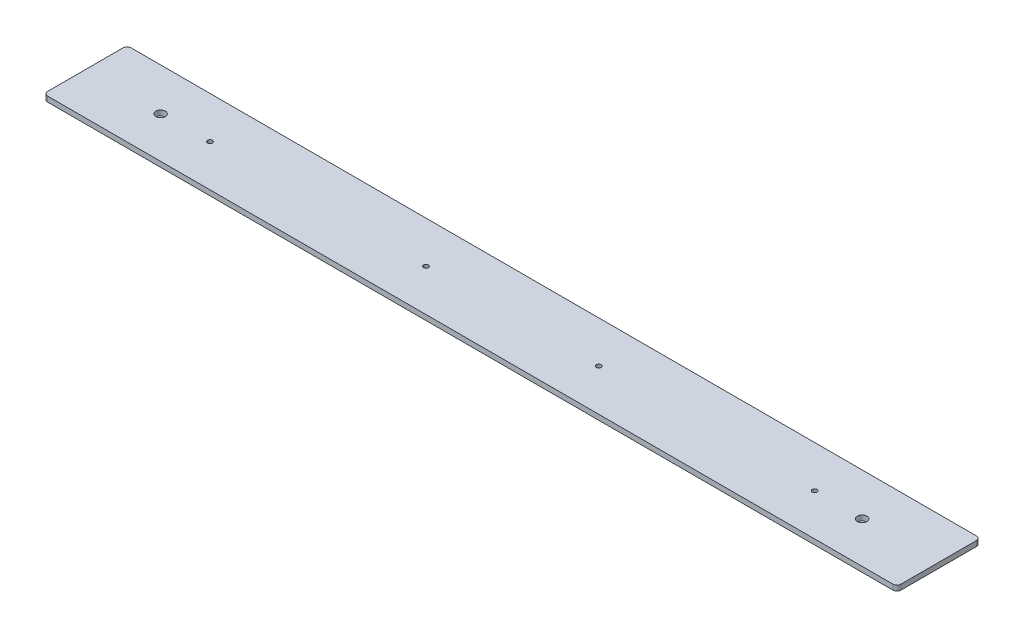
ISO-10303-21;
HEADER;
FILE_DESCRIPTION(('STEP AP214'),'2;1');
FILE_NAME('part.step','',(''),(''),'','','');
FILE_SCHEMA(('AUTOMOTIVE_DESIGN { 1 0 10303 214 1 1 1 1 }'));
ENDSEC;
DATA;
#1=APPLICATION_CONTEXT('core data for automotive mechanical design processes');
#2=APPLICATION_PROTOCOL_DEFINITION('international standard','automotive_design',2000,#1);
#3=PRODUCT_CONTEXT('',#1,'mechanical');
#4=PRODUCT('Part','Part','',(#3));
#5=PRODUCT_RELATED_PRODUCT_CATEGORY('part','',(#4));
#6=PRODUCT_DEFINITION_FORMATION('','',#4);
#7=PRODUCT_DEFINITION_CONTEXT('part definition',#1,'design');
#8=PRODUCT_DEFINITION('design','',#6,#7);
#9=PRODUCT_DEFINITION_SHAPE('','',#8);
#10=(LENGTH_UNIT() NAMED_UNIT(*) SI_UNIT(.MILLI.,.METRE.));
#11=(NAMED_UNIT(*) PLANE_ANGLE_UNIT() SI_UNIT($,.RADIAN.));
#12=(NAMED_UNIT(*) SI_UNIT($,.STERADIAN.) SOLID_ANGLE_UNIT());
#13=UNCERTAINTY_MEASURE_WITH_UNIT(LENGTH_MEASURE(1.E-05),#10,'distance_accuracy_value','');
#14=(GEOMETRIC_REPRESENTATION_CONTEXT(3) GLOBAL_UNCERTAINTY_ASSIGNED_CONTEXT((#13)) GLOBAL_UNIT_ASSIGNED_CONTEXT((#10,
#11,#12)) REPRESENTATION_CONTEXT('',''));
#15=CARTESIAN_POINT('',(0.,0.,0.));
#16=DIRECTION('',(0.,0.,1.));
#17=DIRECTION('',(1.,0.,0.));
#18=AXIS2_PLACEMENT_3D('',#15,#16,#17);
#19=CARTESIAN_POINT('',(259.55625,3.175,25.4));
#20=DIRECTION('',(-1.,0.,0.));
#21=DIRECTION('',(0.,0.,1.));
#22=AXIS2_PLACEMENT_3D('',#19,#20,#21);
#23=PLANE('',#22);
#24=DIRECTION('',(0.,0.,-1.));
#25=VECTOR('',#24,1.);
#26=CARTESIAN_POINT('',(259.55625,0.,25.4));
#27=LINE('',#26,#25);
#28=CARTESIAN_POINT('',(259.55625,0.,22.86));
#29=VERTEX_POINT('',#28);
#30=CARTESIAN_POINT('',(259.55625,0.,-22.86));
#31=VERTEX_POINT('',#30);
#32=EDGE_CURVE('E129',#29,#31,#27,.T.);
#33=ORIENTED_EDGE('',*,*,#32,.T.);
#34=DIRECTION('',(0.,-1.,0.));
#35=VECTOR('',#34,1.);
#36=CARTESIAN_POINT('',(259.55625,3.175,-22.86));
#37=LINE('',#36,#35);
#38=CARTESIAN_POINT('',(259.55625,3.175,-22.86));
#39=VERTEX_POINT('',#38);
#40=EDGE_CURVE('E11',#31,#39,#37,.F.);
#41=ORIENTED_EDGE('',*,*,#40,.T.);
#42=DIRECTION('',(0.,0.,-1.));
#43=VECTOR('',#42,1.);
#44=CARTESIAN_POINT('',(259.55625,3.175,25.4));
#45=LINE('',#44,#43);
#46=CARTESIAN_POINT('',(259.55625,3.175,22.86));
#47=VERTEX_POINT('',#46);
#48=EDGE_CURVE('E127',#47,#39,#45,.T.);
#49=ORIENTED_EDGE('',*,*,#48,.F.);
#50=DIRECTION('',(0.,-1.,0.));
#51=VECTOR('',#50,1.);
#52=CARTESIAN_POINT('',(259.55625,3.175,22.86));
#53=LINE('',#52,#51);
#54=EDGE_CURVE('E41',#47,#29,#53,.T.);
#55=ORIENTED_EDGE('',*,*,#54,.T.);
#56=EDGE_LOOP('',(#33,#41,#49,#55));
#57=FACE_BOUND('',#56,.T.);
#58=ADVANCED_FACE('F33',(#57),#23,.F.);
#59=CARTESIAN_POINT('',(-259.55625,3.175,-25.4));
#60=DIRECTION('',(0.,0.,1.));
#61=DIRECTION('',(1.,0.,0.));
#62=AXIS2_PLACEMENT_3D('',#59,#60,#61);
#63=PLANE('',#62);
#64=DIRECTION('',(-1.,0.,0.));
#65=VECTOR('',#64,1.);
#66=CARTESIAN_POINT('',(-259.55625,0.,-25.4));
#67=LINE('',#66,#65);
#68=CARTESIAN_POINT('',(257.01625,0.,-25.4));
#69=VERTEX_POINT('',#68);
#70=CARTESIAN_POINT('',(-257.01625,0.,-25.4));
#71=VERTEX_POINT('',#70);
#72=EDGE_CURVE('E125',#69,#71,#67,.T.);
#73=ORIENTED_EDGE('',*,*,#72,.T.);
#74=DIRECTION('',(0.,-1.,0.));
#75=VECTOR('',#74,1.);
#76=CARTESIAN_POINT('',(-257.01625,3.175,-25.4));
#77=LINE('',#76,#75);
#78=CARTESIAN_POINT('',(-257.01625,3.175,-25.4));
#79=VERTEX_POINT('',#78);
#80=EDGE_CURVE('E104',#71,#79,#77,.F.);
#81=ORIENTED_EDGE('',*,*,#80,.T.);
#82=DIRECTION('',(-1.,0.,0.));
#83=VECTOR('',#82,1.);
#84=CARTESIAN_POINT('',(-259.55625,3.175,-25.4));
#85=LINE('',#84,#83);
#86=CARTESIAN_POINT('',(257.01625,3.175,-25.4));
#87=VERTEX_POINT('',#86);
#88=EDGE_CURVE('E169',#87,#79,#85,.T.);
#89=ORIENTED_EDGE('',*,*,#88,.F.);
#90=DIRECTION('',(0.,-1.,0.));
#91=VECTOR('',#90,1.);
#92=CARTESIAN_POINT('',(257.01625,3.175,-25.4));
#93=LINE('',#92,#91);
#94=EDGE_CURVE('E109',#87,#69,#93,.T.);
#95=ORIENTED_EDGE('',*,*,#94,.T.);
#96=EDGE_LOOP('',(#73,#81,#89,#95));
#97=FACE_BOUND('',#96,.T.);
#98=ADVANCED_FACE('F226',(#97),#63,.F.);
#99=CARTESIAN_POINT('',(-259.55625,3.175,25.4));
#100=DIRECTION('',(1.,0.,0.));
#101=DIRECTION('',(0.,0.,-1.));
#102=AXIS2_PLACEMENT_3D('',#99,#100,#101);
#103=PLANE('',#102);
#104=DIRECTION('',(0.,0.,1.));
#105=VECTOR('',#104,1.);
#106=CARTESIAN_POINT('',(-259.55625,3.175,25.4));
#107=LINE('',#106,#105);
#108=CARTESIAN_POINT('',(-259.55625,3.175,-22.86));
#109=VERTEX_POINT('',#108);
#110=CARTESIAN_POINT('',(-259.55625,3.175,22.86));
#111=VERTEX_POINT('',#110);
#112=EDGE_CURVE('E118',#109,#111,#107,.T.);
#113=ORIENTED_EDGE('',*,*,#112,.F.);
#114=DIRECTION('',(0.,-1.,0.));
#115=VECTOR('',#114,1.);
#116=CARTESIAN_POINT('',(-259.55625,3.175,-22.86));
#117=LINE('',#116,#115);
#118=CARTESIAN_POINT('',(-259.55625,0.,-22.86));
#119=VERTEX_POINT('',#118);
#120=EDGE_CURVE('E103',#109,#119,#117,.T.);
#121=ORIENTED_EDGE('',*,*,#120,.T.);
#122=DIRECTION('',(0.,0.,1.));
#123=VECTOR('',#122,1.);
#124=CARTESIAN_POINT('',(-259.55625,0.,25.4));
#125=LINE('',#124,#123);
#126=CARTESIAN_POINT('',(-259.55625,0.,22.86));
#127=VERTEX_POINT('',#126);
#128=EDGE_CURVE('E116',#119,#127,#125,.T.);
#129=ORIENTED_EDGE('',*,*,#128,.T.);
#130=DIRECTION('',(0.,-1.,0.));
#131=VECTOR('',#130,1.);
#132=CARTESIAN_POINT('',(-259.55625,3.175,22.86));
#133=LINE('',#132,#131);
#134=EDGE_CURVE('E120',#127,#111,#133,.F.);
#135=ORIENTED_EDGE('',*,*,#134,.T.);
#136=EDGE_LOOP('',(#113,#121,#129,#135));
#137=FACE_BOUND('',#136,.T.);
#138=ADVANCED_FACE('F115',(#137),#103,.F.);
#139=CARTESIAN_POINT('',(-259.55625,3.175,25.4));
#140=DIRECTION('',(0.,0.,-1.));
#141=DIRECTION('',(-1.,0.,0.));
#142=AXIS2_PLACEMENT_3D('',#139,#140,#141);
#143=PLANE('',#142);
#144=DIRECTION('',(1.,0.,0.));
#145=VECTOR('',#144,1.);
#146=CARTESIAN_POINT('',(-259.55625,3.175,25.4));
#147=LINE('',#146,#145);
#148=CARTESIAN_POINT('',(-257.01625,3.175,25.4));
#149=VERTEX_POINT('',#148);
#150=CARTESIAN_POINT('',(257.01625,3.175,25.4));
#151=VERTEX_POINT('',#150);
#152=EDGE_CURVE('E133',#149,#151,#147,.T.);
#153=ORIENTED_EDGE('',*,*,#152,.F.);
#154=DIRECTION('',(0.,-1.,0.));
#155=VECTOR('',#154,1.);
#156=CARTESIAN_POINT('',(-257.01625,3.175,25.4));
#157=LINE('',#156,#155);
#158=CARTESIAN_POINT('',(-257.01625,0.,25.4));
#159=VERTEX_POINT('',#158);
#160=EDGE_CURVE('E150',#149,#159,#157,.T.);
#161=ORIENTED_EDGE('',*,*,#160,.T.);
#162=DIRECTION('',(1.,0.,0.));
#163=VECTOR('',#162,1.);
#164=CARTESIAN_POINT('',(-259.55625,0.,25.4));
#165=LINE('',#164,#163);
#166=CARTESIAN_POINT('',(257.01625,0.,25.4));
#167=VERTEX_POINT('',#166);
#168=EDGE_CURVE('E124',#159,#167,#165,.T.);
#169=ORIENTED_EDGE('',*,*,#168,.T.);
#170=DIRECTION('',(0.,-1.,0.));
#171=VECTOR('',#170,1.);
#172=CARTESIAN_POINT('',(257.01625,3.175,25.4));
#173=LINE('',#172,#171);
#174=EDGE_CURVE('E48',#167,#151,#173,.F.);
#175=ORIENTED_EDGE('',*,*,#174,.T.);
#176=EDGE_LOOP('',(#153,#161,#169,#175));
#177=FACE_BOUND('',#176,.T.);
#178=ADVANCED_FACE('F211',(#177),#143,.F.);
#179=CARTESIAN_POINT('',(0.,3.175,0.));
#180=DIRECTION('',(0.,-1.,0.));
#181=DIRECTION('',(0.,0.,-1.));
#182=AXIS2_PLACEMENT_3D('',#179,#180,#181);
#183=PLANE('',#182);
#184=CARTESIAN_POINT('',(213.359999999999,3.175,0.386930900000061));
#185=DIRECTION('',(0.,1.,0.));
#186=DIRECTION('',(0.,0.,1.));
#187=AXIS2_PLACEMENT_3D('',#184,#185,#186);
#188=CIRCLE('',#187,2.8956);
#189=CARTESIAN_POINT('',(213.359999999999,3.175,3.28253090000006));
#190=VERTEX_POINT('',#189);
#191=EDGE_CURVE('E202',#190,#190,#188,.T.);
#192=ORIENTED_EDGE('',*,*,#191,.F.);
#193=EDGE_LOOP('',(#192));
#194=FACE_BOUND('',#193,.T.);
#195=CARTESIAN_POINT('',(-213.360000000001,3.175,0.386930900000061));
#196=DIRECTION('',(0.,1.,0.));
#197=DIRECTION('',(0.,0.,1.));
#198=AXIS2_PLACEMENT_3D('',#195,#196,#197);
#199=CIRCLE('',#198,2.8956);
#200=CARTESIAN_POINT('',(-213.360000000001,3.175,3.28253090000006));
#201=VERTEX_POINT('',#200);
#202=EDGE_CURVE('E196',#201,#201,#199,.T.);
#203=ORIENTED_EDGE('',*,*,#202,.F.);
#204=EDGE_LOOP('',(#203));
#205=FACE_BOUND('',#204,.T.);
#206=CARTESIAN_POINT('',(184.1103125,3.175,0.));
#207=DIRECTION('',(0.,1.,0.));
#208=DIRECTION('',(0.,0.,1.));
#209=AXIS2_PLACEMENT_3D('',#206,#207,#208);
#210=CIRCLE('',#209,1.47319999999998);
#211=CARTESIAN_POINT('',(184.1103125,3.175,1.47319999999997));
#212=VERTEX_POINT('',#211);
#213=EDGE_CURVE('E190',#212,#212,#210,.T.);
#214=ORIENTED_EDGE('',*,*,#213,.F.);
#215=EDGE_LOOP('',(#214));
#216=FACE_BOUND('',#215,.T.);
#217=CARTESIAN_POINT('',(52.7446874999999,3.175,0.));
#218=DIRECTION('',(0.,1.,0.));
#219=DIRECTION('',(0.,0.,1.));
#220=AXIS2_PLACEMENT_3D('',#217,#218,#219);
#221=CIRCLE('',#220,1.47319999999999);
#222=CARTESIAN_POINT('',(52.7446874999999,3.175,1.47319999999997));
#223=VERTEX_POINT('',#222);
#224=EDGE_CURVE('E184',#223,#223,#221,.T.);
#225=ORIENTED_EDGE('',*,*,#224,.F.);
#226=EDGE_LOOP('',(#225));
#227=FACE_BOUND('',#226,.T.);
#228=CARTESIAN_POINT('',(-52.3478125000001,3.175,0.));
#229=DIRECTION('',(0.,1.,0.));
#230=DIRECTION('',(0.,0.,1.));
#231=AXIS2_PLACEMENT_3D('',#228,#229,#230);
#232=CIRCLE('',#231,1.47319999999999);
#233=CARTESIAN_POINT('',(-52.3478125000001,3.175,1.47319999999997));
#234=VERTEX_POINT('',#233);
#235=EDGE_CURVE('E178',#234,#234,#232,.T.);
#236=ORIENTED_EDGE('',*,*,#235,.F.);
#237=EDGE_LOOP('',(#236));
#238=FACE_BOUND('',#237,.T.);
#239=CARTESIAN_POINT('',(-183.7134375,3.175,0.));
#240=DIRECTION('',(0.,1.,0.));
#241=DIRECTION('',(0.,0.,1.));
#242=AXIS2_PLACEMENT_3D('',#239,#240,#241);
#243=CIRCLE('',#242,1.47319999999998);
#244=CARTESIAN_POINT('',(-183.7134375,3.175,1.47319999999997));
#245=VERTEX_POINT('',#244);
#246=EDGE_CURVE('E164',#245,#245,#243,.T.);
#247=ORIENTED_EDGE('',*,*,#246,.F.);
#248=EDGE_LOOP('',(#247));
#249=FACE_BOUND('',#248,.T.);
#250=ORIENTED_EDGE('',*,*,#88,.T.);
#251=CARTESIAN_POINT('',(-257.01625,3.175,-22.86));
#252=DIRECTION('',(0.,-1.,0.));
#253=DIRECTION('',(0.,0.,-1.));
#254=AXIS2_PLACEMENT_3D('',#251,#252,#253);
#255=CIRCLE('',#254,2.54);
#256=EDGE_CURVE('E147',#79,#109,#255,.F.);
#257=ORIENTED_EDGE('',*,*,#256,.T.);
#258=ORIENTED_EDGE('',*,*,#112,.T.);
#259=CARTESIAN_POINT('',(-257.01625,3.175,22.86));
#260=DIRECTION('',(0.,-1.,0.));
#261=DIRECTION('',(0.,0.,-1.));
#262=AXIS2_PLACEMENT_3D('',#259,#260,#261);
#263=CIRCLE('',#262,2.54);
#264=EDGE_CURVE('E55',#111,#149,#263,.F.);
#265=ORIENTED_EDGE('',*,*,#264,.T.);
#266=ORIENTED_EDGE('',*,*,#152,.T.);
#267=CARTESIAN_POINT('',(257.01625,3.175,22.86));
#268=DIRECTION('',(0.,-1.,0.));
#269=DIRECTION('',(0.,0.,-1.));
#270=AXIS2_PLACEMENT_3D('',#267,#268,#269);
#271=CIRCLE('',#270,2.54);
#272=EDGE_CURVE('E142',#151,#47,#271,.F.);
#273=ORIENTED_EDGE('',*,*,#272,.T.);
#274=ORIENTED_EDGE('',*,*,#48,.T.);
#275=CARTESIAN_POINT('',(257.01625,3.175,-22.86));
#276=DIRECTION('',(0.,-1.,0.));
#277=DIRECTION('',(0.,0.,-1.));
#278=AXIS2_PLACEMENT_3D('',#275,#276,#277);
#279=CIRCLE('',#278,2.54);
#280=EDGE_CURVE('E144',#39,#87,#279,.F.);
#281=ORIENTED_EDGE('',*,*,#280,.T.);
#282=EDGE_LOOP('',(#250,#257,#258,#265,#266,#273,#274,#281));
#283=FACE_BOUND('',#282,.T.);
#284=ADVANCED_FACE('F208',(#194,#205,#216,#227,#238,#249,#283),#183,.F.);
#285=CARTESIAN_POINT('',(0.,0.,0.));
#286=DIRECTION('',(0.,-1.,0.));
#287=DIRECTION('',(0.,0.,-1.));
#288=AXIS2_PLACEMENT_3D('',#285,#286,#287);
#289=PLANE('',#288);
#290=CARTESIAN_POINT('',(213.359999999999,0.,0.386930900000061));
#291=DIRECTION('',(0.,1.,0.));
#292=DIRECTION('',(0.,0.,1.));
#293=AXIS2_PLACEMENT_3D('',#290,#291,#292);
#294=CIRCLE('',#293,2.8956);
#295=CARTESIAN_POINT('',(213.359999999999,0.,3.28253090000006));
#296=VERTEX_POINT('',#295);
#297=EDGE_CURVE('E199',#296,#296,#294,.T.);
#298=ORIENTED_EDGE('',*,*,#297,.T.);
#299=EDGE_LOOP('',(#298));
#300=FACE_BOUND('',#299,.T.);
#301=CARTESIAN_POINT('',(-213.360000000001,0.,0.386930900000061));
#302=DIRECTION('',(0.,1.,0.));
#303=DIRECTION('',(0.,0.,1.));
#304=AXIS2_PLACEMENT_3D('',#301,#302,#303);
#305=CIRCLE('',#304,2.8956);
#306=CARTESIAN_POINT('',(-213.360000000001,0.,3.28253090000006));
#307=VERTEX_POINT('',#306);
#308=EDGE_CURVE('E193',#307,#307,#305,.T.);
#309=ORIENTED_EDGE('',*,*,#308,.T.);
#310=EDGE_LOOP('',(#309));
#311=FACE_BOUND('',#310,.T.);
#312=CARTESIAN_POINT('',(184.1103125,0.,0.));
#313=DIRECTION('',(0.,1.,0.));
#314=DIRECTION('',(0.,0.,1.));
#315=AXIS2_PLACEMENT_3D('',#312,#313,#314);
#316=CIRCLE('',#315,1.47320000000001);
#317=CARTESIAN_POINT('',(184.1103125,0.,1.47319999999999));
#318=VERTEX_POINT('',#317);
#319=EDGE_CURVE('E187',#318,#318,#316,.T.);
#320=ORIENTED_EDGE('',*,*,#319,.T.);
#321=EDGE_LOOP('',(#320));
#322=FACE_BOUND('',#321,.T.);
#323=CARTESIAN_POINT('',(52.7446874999999,0.,0.));
#324=DIRECTION('',(0.,1.,0.));
#325=DIRECTION('',(0.,0.,1.));
#326=AXIS2_PLACEMENT_3D('',#323,#324,#325);
#327=CIRCLE('',#326,1.4732);
#328=CARTESIAN_POINT('',(52.7446874999999,0.,1.47319999999999));
#329=VERTEX_POINT('',#328);
#330=EDGE_CURVE('E181',#329,#329,#327,.T.);
#331=ORIENTED_EDGE('',*,*,#330,.T.);
#332=EDGE_LOOP('',(#331));
#333=FACE_BOUND('',#332,.T.);
#334=CARTESIAN_POINT('',(-52.3478125000001,0.,0.));
#335=DIRECTION('',(0.,1.,0.));
#336=DIRECTION('',(0.,0.,1.));
#337=AXIS2_PLACEMENT_3D('',#334,#335,#336);
#338=CIRCLE('',#337,1.4732);
#339=CARTESIAN_POINT('',(-52.3478125000001,0.,1.47319999999998));
#340=VERTEX_POINT('',#339);
#341=EDGE_CURVE('E175',#340,#340,#338,.T.);
#342=ORIENTED_EDGE('',*,*,#341,.T.);
#343=EDGE_LOOP('',(#342));
#344=FACE_BOUND('',#343,.T.);
#345=CARTESIAN_POINT('',(-183.7134375,0.,0.));
#346=DIRECTION('',(0.,1.,0.));
#347=DIRECTION('',(0.,0.,1.));
#348=AXIS2_PLACEMENT_3D('',#345,#346,#347);
#349=CIRCLE('',#348,1.47320000000001);
#350=CARTESIAN_POINT('',(-183.7134375,0.,1.47319999999999));
#351=VERTEX_POINT('',#350);
#352=EDGE_CURVE('E162',#351,#351,#349,.T.);
#353=ORIENTED_EDGE('',*,*,#352,.T.);
#354=EDGE_LOOP('',(#353));
#355=FACE_BOUND('',#354,.T.);
#356=ORIENTED_EDGE('',*,*,#128,.F.);
#357=CARTESIAN_POINT('',(-257.01625,0.,-22.86));
#358=DIRECTION('',(0.,-1.,0.));
#359=DIRECTION('',(0.,0.,-1.));
#360=AXIS2_PLACEMENT_3D('',#357,#358,#359);
#361=CIRCLE('',#360,2.54);
#362=EDGE_CURVE('E99',#119,#71,#361,.T.);
#363=ORIENTED_EDGE('',*,*,#362,.T.);
#364=ORIENTED_EDGE('',*,*,#72,.F.);
#365=CARTESIAN_POINT('',(257.01625,0.,-22.86));
#366=DIRECTION('',(0.,-1.,0.));
#367=DIRECTION('',(0.,0.,-1.));
#368=AXIS2_PLACEMENT_3D('',#365,#366,#367);
#369=CIRCLE('',#368,2.54);
#370=EDGE_CURVE('E136',#69,#31,#369,.T.);
#371=ORIENTED_EDGE('',*,*,#370,.T.);
#372=ORIENTED_EDGE('',*,*,#32,.F.);
#373=CARTESIAN_POINT('',(257.01625,0.,22.86));
#374=DIRECTION('',(0.,-1.,0.));
#375=DIRECTION('',(0.,0.,-1.));
#376=AXIS2_PLACEMENT_3D('',#373,#374,#375);
#377=CIRCLE('',#376,2.54);
#378=EDGE_CURVE('E119',#29,#167,#377,.T.);
#379=ORIENTED_EDGE('',*,*,#378,.T.);
#380=ORIENTED_EDGE('',*,*,#168,.F.);
#381=CARTESIAN_POINT('',(-257.01625,0.,22.86));
#382=DIRECTION('',(0.,-1.,0.));
#383=DIRECTION('',(0.,0.,-1.));
#384=AXIS2_PLACEMENT_3D('',#381,#382,#383);
#385=CIRCLE('',#384,2.54);
#386=EDGE_CURVE('E110',#159,#127,#385,.T.);
#387=ORIENTED_EDGE('',*,*,#386,.T.);
#388=EDGE_LOOP('',(#356,#363,#364,#371,#372,#379,#380,#387));
#389=FACE_BOUND('',#388,.T.);
#390=ADVANCED_FACE('F122',(#300,#311,#322,#333,#344,#355,#389),#289,.T.);
#391=CARTESIAN_POINT('',(-257.01625,3.175,-22.86));
#392=DIRECTION('',(0.,-1.,0.));
#393=DIRECTION('',(0.,0.,-1.));
#394=AXIS2_PLACEMENT_3D('',#391,#392,#393);
#395=CYLINDRICAL_SURFACE('',#394,2.54);
#396=ORIENTED_EDGE('',*,*,#256,.F.);
#397=ORIENTED_EDGE('',*,*,#80,.F.);
#398=ORIENTED_EDGE('',*,*,#362,.F.);
#399=ORIENTED_EDGE('',*,*,#120,.F.);
#400=EDGE_LOOP('',(#396,#397,#398,#399));
#401=FACE_BOUND('',#400,.T.);
#402=ADVANCED_FACE('F102',(#401),#395,.T.);
#403=CARTESIAN_POINT('',(-257.01625,3.175,22.86));
#404=DIRECTION('',(0.,-1.,0.));
#405=DIRECTION('',(0.,0.,-1.));
#406=AXIS2_PLACEMENT_3D('',#403,#404,#405);
#407=CYLINDRICAL_SURFACE('',#406,2.54);
#408=ORIENTED_EDGE('',*,*,#264,.F.);
#409=ORIENTED_EDGE('',*,*,#134,.F.);
#410=ORIENTED_EDGE('',*,*,#386,.F.);
#411=ORIENTED_EDGE('',*,*,#160,.F.);
#412=EDGE_LOOP('',(#408,#409,#410,#411));
#413=FACE_BOUND('',#412,.T.);
#414=ADVANCED_FACE('F238',(#413),#407,.T.);
#415=CARTESIAN_POINT('',(257.01625,3.175,-22.86));
#416=DIRECTION('',(0.,-1.,0.));
#417=DIRECTION('',(0.,0.,-1.));
#418=AXIS2_PLACEMENT_3D('',#415,#416,#417);
#419=CYLINDRICAL_SURFACE('',#418,2.54);
#420=ORIENTED_EDGE('',*,*,#280,.F.);
#421=ORIENTED_EDGE('',*,*,#40,.F.);
#422=ORIENTED_EDGE('',*,*,#370,.F.);
#423=ORIENTED_EDGE('',*,*,#94,.F.);
#424=EDGE_LOOP('',(#420,#421,#422,#423));
#425=FACE_BOUND('',#424,.T.);
#426=ADVANCED_FACE('F228',(#425),#419,.T.);
#427=CARTESIAN_POINT('',(257.01625,3.175,22.86));
#428=DIRECTION('',(0.,-1.,0.));
#429=DIRECTION('',(0.,0.,-1.));
#430=AXIS2_PLACEMENT_3D('',#427,#428,#429);
#431=CYLINDRICAL_SURFACE('',#430,2.54);
#432=ORIENTED_EDGE('',*,*,#272,.F.);
#433=ORIENTED_EDGE('',*,*,#174,.F.);
#434=ORIENTED_EDGE('',*,*,#378,.F.);
#435=ORIENTED_EDGE('',*,*,#54,.F.);
#436=EDGE_LOOP('',(#432,#433,#434,#435));
#437=FACE_BOUND('',#436,.T.);
#438=ADVANCED_FACE('F35',(#437),#431,.T.);
#439=CARTESIAN_POINT('',(-183.7134375,3.175,0.));
#440=DIRECTION('',(0.,1.,0.));
#441=DIRECTION('',(0.,0.,1.));
#442=AXIS2_PLACEMENT_3D('',#439,#440,#441);
#443=CYLINDRICAL_SURFACE('',#442,1.47319999999999);
#444=ORIENTED_EDGE('',*,*,#352,.F.);
#445=EDGE_LOOP('',(#444));
#446=FACE_BOUND('',#445,.T.);
#447=ORIENTED_EDGE('',*,*,#246,.T.);
#448=EDGE_LOOP('',(#447));
#449=FACE_BOUND('',#448,.T.);
#450=ADVANCED_FACE('F230',(#446,#449),#443,.F.);
#451=CARTESIAN_POINT('',(-52.3478125000001,3.175,0.));
#452=DIRECTION('',(0.,1.,0.));
#453=DIRECTION('',(0.,0.,1.));
#454=AXIS2_PLACEMENT_3D('',#451,#452,#453);
#455=CYLINDRICAL_SURFACE('',#454,1.47319999999999);
#456=ORIENTED_EDGE('',*,*,#341,.F.);
#457=EDGE_LOOP('',(#456));
#458=FACE_BOUND('',#457,.T.);
#459=ORIENTED_EDGE('',*,*,#235,.T.);
#460=EDGE_LOOP('',(#459));
#461=FACE_BOUND('',#460,.T.);
#462=ADVANCED_FACE('F235',(#458,#461),#455,.F.);
#463=CARTESIAN_POINT('',(52.7446874999999,3.175,0.));
#464=DIRECTION('',(0.,1.,0.));
#465=DIRECTION('',(0.,0.,1.));
#466=AXIS2_PLACEMENT_3D('',#463,#464,#465);
#467=CYLINDRICAL_SURFACE('',#466,1.47319999999999);
#468=ORIENTED_EDGE('',*,*,#330,.F.);
#469=EDGE_LOOP('',(#468));
#470=FACE_BOUND('',#469,.T.);
#471=ORIENTED_EDGE('',*,*,#224,.T.);
#472=EDGE_LOOP('',(#471));
#473=FACE_BOUND('',#472,.T.);
#474=ADVANCED_FACE('F266',(#470,#473),#467,.F.);
#475=CARTESIAN_POINT('',(184.1103125,3.175,0.));
#476=DIRECTION('',(0.,1.,0.));
#477=DIRECTION('',(0.,0.,1.));
#478=AXIS2_PLACEMENT_3D('',#475,#476,#477);
#479=CYLINDRICAL_SURFACE('',#478,1.47319999999999);
#480=ORIENTED_EDGE('',*,*,#319,.F.);
#481=EDGE_LOOP('',(#480));
#482=FACE_BOUND('',#481,.T.);
#483=ORIENTED_EDGE('',*,*,#213,.T.);
#484=EDGE_LOOP('',(#483));
#485=FACE_BOUND('',#484,.T.);
#486=ADVANCED_FACE('F270',(#482,#485),#479,.F.);
#487=CARTESIAN_POINT('',(-213.360000000001,3.175,0.386930900000061));
#488=DIRECTION('',(0.,1.,0.));
#489=DIRECTION('',(0.,0.,1.));
#490=AXIS2_PLACEMENT_3D('',#487,#488,#489);
#491=CYLINDRICAL_SURFACE('',#490,2.8956);
#492=ORIENTED_EDGE('',*,*,#308,.F.);
#493=EDGE_LOOP('',(#492));
#494=FACE_BOUND('',#493,.T.);
#495=ORIENTED_EDGE('',*,*,#202,.T.);
#496=EDGE_LOOP('',(#495));
#497=FACE_BOUND('',#496,.T.);
#498=ADVANCED_FACE('F274',(#494,#497),#491,.F.);
#499=CARTESIAN_POINT('',(213.359999999999,3.175,0.386930900000061));
#500=DIRECTION('',(0.,1.,0.));
#501=DIRECTION('',(0.,0.,1.));
#502=AXIS2_PLACEMENT_3D('',#499,#500,#501);
#503=CYLINDRICAL_SURFACE('',#502,2.8956);
#504=ORIENTED_EDGE('',*,*,#297,.F.);
#505=EDGE_LOOP('',(#504));
#506=FACE_BOUND('',#505,.T.);
#507=ORIENTED_EDGE('',*,*,#191,.T.);
#508=EDGE_LOOP('',(#507));
#509=FACE_BOUND('',#508,.T.);
#510=ADVANCED_FACE('F206',(#506,#509),#503,.F.);
#511=CLOSED_SHELL('',(#58,#98,#138,#178,#284,#390,#402,#414,#426,#438,#450,#462,#474,#486,#498,#510));
#512=MANIFOLD_SOLID_BREP('B2',#511);
#513=ADVANCED_BREP_SHAPE_REPRESENTATION('',(#18,#512),#14);
#514=SHAPE_DEFINITION_REPRESENTATION(#9,#513);
ENDSEC;
END-ISO-10303-21;
